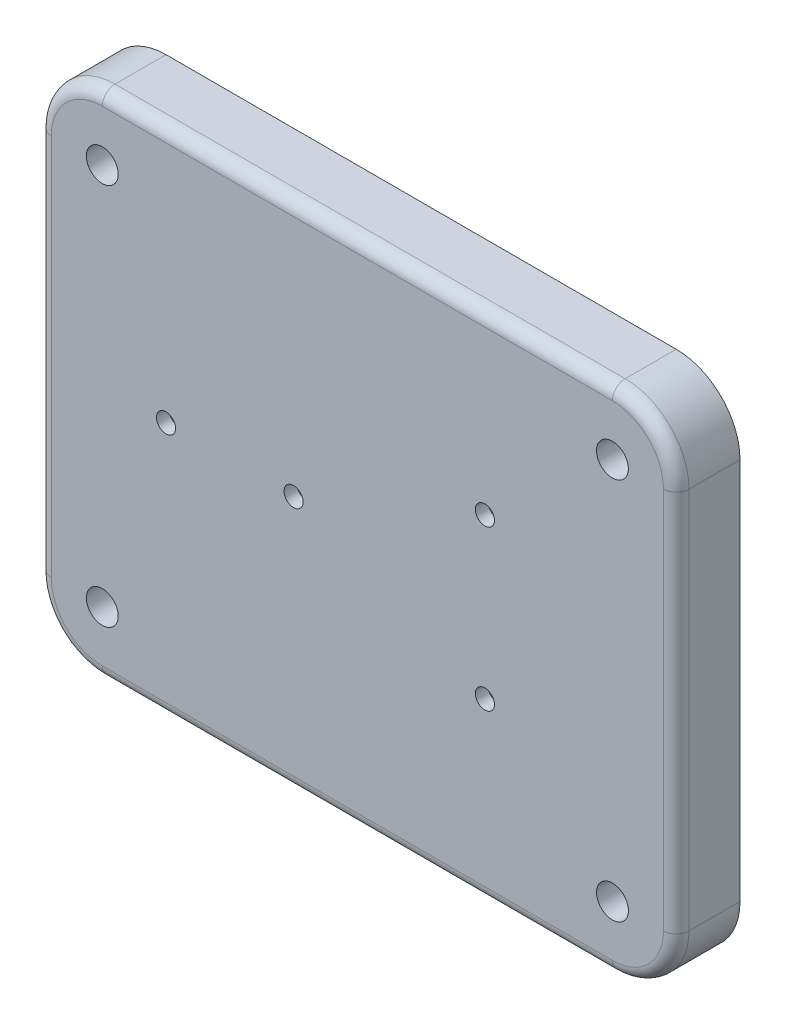
ISO-10303-21;
HEADER;
FILE_DESCRIPTION(('STEP AP214'),'2;1');
FILE_NAME('part.step','',(''),(''),'','','');
FILE_SCHEMA(('AUTOMOTIVE_DESIGN { 1 0 10303 214 1 1 1 1 }'));
ENDSEC;
DATA;
#1=APPLICATION_CONTEXT('core data for automotive mechanical design processes');
#2=APPLICATION_PROTOCOL_DEFINITION('international standard','automotive_design',2000,#1);
#3=PRODUCT_CONTEXT('',#1,'mechanical');
#4=PRODUCT('Part','Part','',(#3));
#5=PRODUCT_RELATED_PRODUCT_CATEGORY('part','',(#4));
#6=PRODUCT_DEFINITION_FORMATION('','',#4);
#7=PRODUCT_DEFINITION_CONTEXT('part definition',#1,'design');
#8=PRODUCT_DEFINITION('design','',#6,#7);
#9=PRODUCT_DEFINITION_SHAPE('','',#8);
#10=(LENGTH_UNIT() NAMED_UNIT(*) SI_UNIT(.MILLI.,.METRE.));
#11=(NAMED_UNIT(*) PLANE_ANGLE_UNIT() SI_UNIT($,.RADIAN.));
#12=(NAMED_UNIT(*) SI_UNIT($,.STERADIAN.) SOLID_ANGLE_UNIT());
#13=UNCERTAINTY_MEASURE_WITH_UNIT(LENGTH_MEASURE(1.E-05),#10,'distance_accuracy_value','');
#14=(GEOMETRIC_REPRESENTATION_CONTEXT(3) GLOBAL_UNCERTAINTY_ASSIGNED_CONTEXT((#13)) GLOBAL_UNIT_ASSIGNED_CONTEXT((#10,
#11,#12)) REPRESENTATION_CONTEXT('',''));
#15=CARTESIAN_POINT('',(0.,0.,0.));
#16=DIRECTION('',(0.,0.,1.));
#17=DIRECTION('',(1.,0.,0.));
#18=AXIS2_PLACEMENT_3D('',#15,#16,#17);
#19=CARTESIAN_POINT('',(0.,0.,0.));
#20=DIRECTION('',(0.,0.,-1.));
#21=DIRECTION('',(-1.,0.,0.));
#22=AXIS2_PLACEMENT_3D('',#19,#20,#21);
#23=PLANE('',#22);
#24=CARTESIAN_POINT('',(40.,30.,0.));
#25=DIRECTION('',(0.,0.,-1.));
#26=DIRECTION('',(-1.,0.,0.));
#27=AXIS2_PLACEMENT_3D('',#24,#25,#26);
#28=CIRCLE('',#27,2.5);
#29=CARTESIAN_POINT('',(37.5,30.,0.));
#30=VERTEX_POINT('',#29);
#31=EDGE_CURVE('E271',#30,#30,#28,.T.);
#32=ORIENTED_EDGE('',*,*,#31,.F.);
#33=EDGE_LOOP('',(#32));
#34=FACE_BOUND('',#33,.T.);
#35=CARTESIAN_POINT('',(40.,30.,0.));
#36=DIRECTION('',(0.,0.,-1.));
#37=DIRECTION('',(-1.,0.,0.));
#38=AXIS2_PLACEMENT_3D('',#35,#36,#37);
#39=CIRCLE('',#38,4.5);
#40=CARTESIAN_POINT('',(35.5,30.,0.));
#41=VERTEX_POINT('',#40);
#42=EDGE_CURVE('E225',#41,#41,#39,.T.);
#43=ORIENTED_EDGE('',*,*,#42,.T.);
#44=EDGE_LOOP('',(#43));
#45=FACE_BOUND('',#44,.T.);
#46=ADVANCED_FACE('F36',(#34,#45),#23,.T.);
#47=CARTESIAN_POINT('',(-40.,-30.,0.));
#48=DIRECTION('',(0.,0.,-1.));
#49=DIRECTION('',(1.,0.,0.));
#50=AXIS2_PLACEMENT_3D('',#47,#48,#49);
#51=CIRCLE('',#50,2.5);
#52=CARTESIAN_POINT('',(-37.5,-30.,0.));
#53=VERTEX_POINT('',#52);
#54=EDGE_CURVE('E285',#53,#53,#51,.T.);
#55=ORIENTED_EDGE('',*,*,#54,.F.);
#56=EDGE_LOOP('',(#55));
#57=FACE_BOUND('',#56,.T.);
#58=CARTESIAN_POINT('',(-40.,-30.,0.));
#59=DIRECTION('',(0.,0.,-1.));
#60=DIRECTION('',(-1.,0.,0.));
#61=AXIS2_PLACEMENT_3D('',#58,#59,#60);
#62=CIRCLE('',#61,4.5);
#63=CARTESIAN_POINT('',(-44.5,-30.,0.));
#64=VERTEX_POINT('',#63);
#65=EDGE_CURVE('E233',#64,#64,#62,.T.);
#66=ORIENTED_EDGE('',*,*,#65,.T.);
#67=EDGE_LOOP('',(#66));
#68=FACE_BOUND('',#67,.T.);
#69=ADVANCED_FACE('F470',(#57,#68),#23,.T.);
#70=CARTESIAN_POINT('',(40.,-30.,0.));
#71=DIRECTION('',(0.,0.,-1.));
#72=DIRECTION('',(-1.,0.,0.));
#73=AXIS2_PLACEMENT_3D('',#70,#71,#72);
#74=CIRCLE('',#73,4.5);
#75=CARTESIAN_POINT('',(35.5,-30.,0.));
#76=VERTEX_POINT('',#75);
#77=EDGE_CURVE('E229',#76,#76,#74,.F.);
#78=ORIENTED_EDGE('',*,*,#77,.F.);
#79=EDGE_LOOP('',(#78));
#80=FACE_BOUND('',#79,.T.);
#81=CARTESIAN_POINT('',(40.,-30.,0.));
#82=DIRECTION('',(0.,0.,1.));
#83=DIRECTION('',(-1.,0.,0.));
#84=AXIS2_PLACEMENT_3D('',#81,#82,#83);
#85=CIRCLE('',#84,2.5);
#86=CARTESIAN_POINT('',(37.5,-30.,0.));
#87=VERTEX_POINT('',#86);
#88=EDGE_CURVE('E279',#87,#87,#85,.T.);
#89=ORIENTED_EDGE('',*,*,#88,.T.);
#90=EDGE_LOOP('',(#89));
#91=FACE_BOUND('',#90,.T.);
#92=ADVANCED_FACE('F476',(#80,#91),#23,.T.);
#93=DIRECTION('',(1.,0.,0.));
#94=VECTOR('',#93,1.);
#95=CARTESIAN_POINT('',(-50.,-40.,0.));
#96=LINE('',#95,#94);
#97=CARTESIAN_POINT('',(-40.,-40.,0.));
#98=VERTEX_POINT('',#97);
#99=CARTESIAN_POINT('',(40.,-40.,0.));
#100=VERTEX_POINT('',#99);
#101=EDGE_CURVE('E305',#98,#100,#96,.T.);
#102=ORIENTED_EDGE('',*,*,#101,.F.);
#103=CARTESIAN_POINT('',(-40.,-30.,0.));
#104=DIRECTION('',(0.,0.,-1.));
#105=DIRECTION('',(-1.,0.,0.));
#106=AXIS2_PLACEMENT_3D('',#103,#104,#105);
#107=CIRCLE('',#106,10.);
#108=CARTESIAN_POINT('',(-50.,-30.,0.));
#109=VERTEX_POINT('',#108);
#110=EDGE_CURVE('E318',#98,#109,#107,.T.);
#111=ORIENTED_EDGE('',*,*,#110,.T.);
#112=DIRECTION('',(0.,-1.,0.));
#113=VECTOR('',#112,1.);
#114=CARTESIAN_POINT('',(-50.,-40.,0.));
#115=LINE('',#114,#113);
#116=CARTESIAN_POINT('',(-50.,30.,0.));
#117=VERTEX_POINT('',#116);
#118=EDGE_CURVE('E302',#117,#109,#115,.T.);
#119=ORIENTED_EDGE('',*,*,#118,.F.);
#120=CARTESIAN_POINT('',(-40.,30.,0.));
#121=DIRECTION('',(0.,0.,-1.));
#122=DIRECTION('',(-1.,0.,0.));
#123=AXIS2_PLACEMENT_3D('',#120,#121,#122);
#124=CIRCLE('',#123,10.);
#125=CARTESIAN_POINT('',(-40.,40.,0.));
#126=VERTEX_POINT('',#125);
#127=EDGE_CURVE('E312',#117,#126,#124,.T.);
#128=ORIENTED_EDGE('',*,*,#127,.T.);
#129=DIRECTION('',(-1.,0.,0.));
#130=VECTOR('',#129,1.);
#131=CARTESIAN_POINT('',(-50.,40.,0.));
#132=LINE('',#131,#130);
#133=CARTESIAN_POINT('',(40.,40.,0.));
#134=VERTEX_POINT('',#133);
#135=EDGE_CURVE('E299',#134,#126,#132,.T.);
#136=ORIENTED_EDGE('',*,*,#135,.F.);
#137=CARTESIAN_POINT('',(40.,30.,0.));
#138=DIRECTION('',(0.,0.,-1.));
#139=DIRECTION('',(-1.,0.,0.));
#140=AXIS2_PLACEMENT_3D('',#137,#138,#139);
#141=CIRCLE('',#140,10.);
#142=CARTESIAN_POINT('',(50.,30.,0.));
#143=VERTEX_POINT('',#142);
#144=EDGE_CURVE('E314',#134,#143,#141,.T.);
#145=ORIENTED_EDGE('',*,*,#144,.T.);
#146=DIRECTION('',(0.,1.,0.));
#147=VECTOR('',#146,1.);
#148=CARTESIAN_POINT('',(50.,-40.,0.));
#149=LINE('',#148,#147);
#150=CARTESIAN_POINT('',(50.,-30.,0.));
#151=VERTEX_POINT('',#150);
#152=EDGE_CURVE('E294',#151,#143,#149,.T.);
#153=ORIENTED_EDGE('',*,*,#152,.F.);
#154=CARTESIAN_POINT('',(40.,-30.,0.));
#155=DIRECTION('',(0.,0.,-1.));
#156=DIRECTION('',(-1.,0.,0.));
#157=AXIS2_PLACEMENT_3D('',#154,#155,#156);
#158=CIRCLE('',#157,10.);
#159=EDGE_CURVE('E316',#151,#100,#158,.T.);
#160=ORIENTED_EDGE('',*,*,#159,.T.);
#161=EDGE_LOOP('',(#102,#111,#119,#128,#136,#145,#153,#160));
#162=FACE_BOUND('',#161,.T.);
#163=CARTESIAN_POINT('',(-40.,-30.,0.));
#164=DIRECTION('',(0.,0.,-1.));
#165=DIRECTION('',(-1.,0.,0.));
#166=AXIS2_PLACEMENT_3D('',#163,#164,#165);
#167=CIRCLE('',#166,8.);
#168=CARTESIAN_POINT('',(-40.,-38.,0.));
#169=VERTEX_POINT('',#168);
#170=CARTESIAN_POINT('',(-48.,-30.,0.));
#171=VERTEX_POINT('',#170);
#172=EDGE_CURVE('E240',#169,#171,#167,.T.);
#173=ORIENTED_EDGE('',*,*,#172,.F.);
#174=DIRECTION('',(1.,0.,0.));
#175=VECTOR('',#174,1.);
#176=CARTESIAN_POINT('',(0.,-38.,0.));
#177=LINE('',#176,#175);
#178=CARTESIAN_POINT('',(40.,-38.,0.));
#179=VERTEX_POINT('',#178);
#180=EDGE_CURVE('E248',#169,#179,#177,.T.);
#181=ORIENTED_EDGE('',*,*,#180,.T.);
#182=CARTESIAN_POINT('',(40.,-30.,0.));
#183=DIRECTION('',(0.,0.,-1.));
#184=DIRECTION('',(-1.,0.,0.));
#185=AXIS2_PLACEMENT_3D('',#182,#183,#184);
#186=CIRCLE('',#185,8.);
#187=CARTESIAN_POINT('',(48.,-30.,0.));
#188=VERTEX_POINT('',#187);
#189=EDGE_CURVE('E251',#188,#179,#186,.T.);
#190=ORIENTED_EDGE('',*,*,#189,.F.);
#191=DIRECTION('',(0.,1.,0.));
#192=VECTOR('',#191,1.);
#193=CARTESIAN_POINT('',(48.,0.,0.));
#194=LINE('',#193,#192);
#195=CARTESIAN_POINT('',(48.,30.,0.));
#196=VERTEX_POINT('',#195);
#197=EDGE_CURVE('E53',#188,#196,#194,.T.);
#198=ORIENTED_EDGE('',*,*,#197,.T.);
#199=CARTESIAN_POINT('',(40.,30.,0.));
#200=DIRECTION('',(0.,0.,-1.));
#201=DIRECTION('',(-1.,0.,0.));
#202=AXIS2_PLACEMENT_3D('',#199,#200,#201);
#203=CIRCLE('',#202,8.);
#204=CARTESIAN_POINT('',(40.,38.,0.));
#205=VERTEX_POINT('',#204);
#206=EDGE_CURVE('E200',#205,#196,#203,.T.);
#207=ORIENTED_EDGE('',*,*,#206,.F.);
#208=DIRECTION('',(-1.,0.,0.));
#209=VECTOR('',#208,1.);
#210=CARTESIAN_POINT('',(0.,38.,0.));
#211=LINE('',#210,#209);
#212=CARTESIAN_POINT('',(-40.,38.,0.));
#213=VERTEX_POINT('',#212);
#214=EDGE_CURVE('E250',#205,#213,#211,.T.);
#215=ORIENTED_EDGE('',*,*,#214,.T.);
#216=CARTESIAN_POINT('',(-40.,30.,0.));
#217=DIRECTION('',(0.,0.,-1.));
#218=DIRECTION('',(-1.,0.,0.));
#219=AXIS2_PLACEMENT_3D('',#216,#217,#218);
#220=CIRCLE('',#219,8.);
#221=CARTESIAN_POINT('',(-48.,30.,0.));
#222=VERTEX_POINT('',#221);
#223=EDGE_CURVE('E244',#222,#213,#220,.T.);
#224=ORIENTED_EDGE('',*,*,#223,.F.);
#225=DIRECTION('',(0.,-1.,0.));
#226=VECTOR('',#225,1.);
#227=CARTESIAN_POINT('',(-48.,0.,0.));
#228=LINE('',#227,#226);
#229=EDGE_CURVE('E255',#222,#171,#228,.T.);
#230=ORIENTED_EDGE('',*,*,#229,.T.);
#231=EDGE_LOOP('',(#173,#181,#190,#198,#207,#215,#224,#230));
#232=FACE_BOUND('',#231,.T.);
#233=ADVANCED_FACE('F484',(#162,#232),#23,.T.);
#234=CARTESIAN_POINT('',(50.,-40.,10.));
#235=DIRECTION('',(-1.,0.,0.));
#236=DIRECTION('',(0.,0.,1.));
#237=AXIS2_PLACEMENT_3D('',#234,#235,#236);
#238=PLANE('',#237);
#239=DIRECTION('',(0.,0.,-1.));
#240=VECTOR('',#239,1.);
#241=CARTESIAN_POINT('',(50.,30.,10.));
#242=LINE('',#241,#240);
#243=CARTESIAN_POINT('',(50.,30.,8.));
#244=VERTEX_POINT('',#243);
#245=EDGE_CURVE('E325',#143,#244,#242,.F.);
#246=ORIENTED_EDGE('',*,*,#245,.T.);
#247=DIRECTION('',(0.,1.,0.));
#248=VECTOR('',#247,1.);
#249=CARTESIAN_POINT('',(50.,-40.,8.));
#250=LINE('',#249,#248);
#251=CARTESIAN_POINT('',(50.,-30.,8.));
#252=VERTEX_POINT('',#251);
#253=EDGE_CURVE('E363',#244,#252,#250,.F.);
#254=ORIENTED_EDGE('',*,*,#253,.T.);
#255=DIRECTION('',(0.,0.,-1.));
#256=VECTOR('',#255,1.);
#257=CARTESIAN_POINT('',(50.,-30.,10.));
#258=LINE('',#257,#256);
#259=EDGE_CURVE('E328',#252,#151,#258,.T.);
#260=ORIENTED_EDGE('',*,*,#259,.T.);
#261=ORIENTED_EDGE('',*,*,#152,.T.);
#262=EDGE_LOOP('',(#246,#254,#260,#261));
#263=FACE_BOUND('',#262,.T.);
#264=ADVANCED_FACE('F494',(#263),#238,.F.);
#265=CARTESIAN_POINT('',(-50.,40.,10.));
#266=DIRECTION('',(0.,-1.,0.));
#267=DIRECTION('',(0.,0.,-1.));
#268=AXIS2_PLACEMENT_3D('',#265,#266,#267);
#269=PLANE('',#268);
#270=DIRECTION('',(0.,0.,-1.));
#271=VECTOR('',#270,1.);
#272=CARTESIAN_POINT('',(-40.,40.,10.));
#273=LINE('',#272,#271);
#274=CARTESIAN_POINT('',(-40.,40.,8.));
#275=VERTEX_POINT('',#274);
#276=EDGE_CURVE('E330',#126,#275,#273,.F.);
#277=ORIENTED_EDGE('',*,*,#276,.T.);
#278=DIRECTION('',(-1.,0.,0.));
#279=VECTOR('',#278,1.);
#280=CARTESIAN_POINT('',(-50.,40.,8.));
#281=LINE('',#280,#279);
#282=CARTESIAN_POINT('',(40.,40.,8.));
#283=VERTEX_POINT('',#282);
#284=EDGE_CURVE('E359',#275,#283,#281,.F.);
#285=ORIENTED_EDGE('',*,*,#284,.T.);
#286=DIRECTION('',(0.,0.,-1.));
#287=VECTOR('',#286,1.);
#288=CARTESIAN_POINT('',(40.,40.,10.));
#289=LINE('',#288,#287);
#290=EDGE_CURVE('E333',#283,#134,#289,.T.);
#291=ORIENTED_EDGE('',*,*,#290,.T.);
#292=ORIENTED_EDGE('',*,*,#135,.T.);
#293=EDGE_LOOP('',(#277,#285,#291,#292));
#294=FACE_BOUND('',#293,.T.);
#295=ADVANCED_FACE('F500',(#294),#269,.F.);
#296=CARTESIAN_POINT('',(-50.,-40.,10.));
#297=DIRECTION('',(1.,0.,0.));
#298=DIRECTION('',(0.,0.,-1.));
#299=AXIS2_PLACEMENT_3D('',#296,#297,#298);
#300=PLANE('',#299);
#301=DIRECTION('',(0.,0.,-1.));
#302=VECTOR('',#301,1.);
#303=CARTESIAN_POINT('',(-50.,-30.,10.));
#304=LINE('',#303,#302);
#305=CARTESIAN_POINT('',(-50.,-30.,8.));
#306=VERTEX_POINT('',#305);
#307=EDGE_CURVE('E322',#109,#306,#304,.F.);
#308=ORIENTED_EDGE('',*,*,#307,.T.);
#309=DIRECTION('',(0.,-1.,0.));
#310=VECTOR('',#309,1.);
#311=CARTESIAN_POINT('',(-50.,-40.,8.));
#312=LINE('',#311,#310);
#313=CARTESIAN_POINT('',(-50.,30.,8.));
#314=VERTEX_POINT('',#313);
#315=EDGE_CURVE('E355',#306,#314,#312,.F.);
#316=ORIENTED_EDGE('',*,*,#315,.T.);
#317=DIRECTION('',(0.,0.,-1.));
#318=VECTOR('',#317,1.);
#319=CARTESIAN_POINT('',(-50.,30.,10.));
#320=LINE('',#319,#318);
#321=EDGE_CURVE('E320',#314,#117,#320,.T.);
#322=ORIENTED_EDGE('',*,*,#321,.T.);
#323=ORIENTED_EDGE('',*,*,#118,.T.);
#324=EDGE_LOOP('',(#308,#316,#322,#323));
#325=FACE_BOUND('',#324,.T.);
#326=ADVANCED_FACE('F762',(#325),#300,.F.);
#327=CARTESIAN_POINT('',(-50.,-40.,10.));
#328=DIRECTION('',(0.,1.,0.));
#329=DIRECTION('',(0.,0.,1.));
#330=AXIS2_PLACEMENT_3D('',#327,#328,#329);
#331=PLANE('',#330);
#332=DIRECTION('',(0.,0.,-1.));
#333=VECTOR('',#332,1.);
#334=CARTESIAN_POINT('',(40.,-40.,10.));
#335=LINE('',#334,#333);
#336=CARTESIAN_POINT('',(40.,-40.,8.));
#337=VERTEX_POINT('',#336);
#338=EDGE_CURVE('E308',#100,#337,#335,.F.);
#339=ORIENTED_EDGE('',*,*,#338,.T.);
#340=DIRECTION('',(1.,0.,0.));
#341=VECTOR('',#340,1.);
#342=CARTESIAN_POINT('',(-50.,-40.,8.));
#343=LINE('',#342,#341);
#344=CARTESIAN_POINT('',(-40.,-40.,8.));
#345=VERTEX_POINT('',#344);
#346=EDGE_CURVE('E11',#337,#345,#343,.F.);
#347=ORIENTED_EDGE('',*,*,#346,.T.);
#348=DIRECTION('',(0.,0.,-1.));
#349=VECTOR('',#348,1.);
#350=CARTESIAN_POINT('',(-40.,-40.,10.));
#351=LINE('',#350,#349);
#352=EDGE_CURVE('E310',#345,#98,#351,.T.);
#353=ORIENTED_EDGE('',*,*,#352,.T.);
#354=ORIENTED_EDGE('',*,*,#101,.T.);
#355=EDGE_LOOP('',(#339,#347,#353,#354));
#356=FACE_BOUND('',#355,.T.);
#357=ADVANCED_FACE('F436',(#356),#331,.F.);
#358=CARTESIAN_POINT('',(0.,0.,10.));
#359=DIRECTION('',(0.,0.,-1.));
#360=DIRECTION('',(-1.,0.,0.));
#361=AXIS2_PLACEMENT_3D('',#358,#359,#360);
#362=PLANE('',#361);
#363=CARTESIAN_POINT('',(20.,12.5,10.));
#364=DIRECTION('',(0.,0.,1.));
#365=DIRECTION('',(1.,0.,0.));
#366=AXIS2_PLACEMENT_3D('',#363,#364,#365);
#367=CIRCLE('',#366,1.5);
#368=CARTESIAN_POINT('',(21.5,12.5,10.));
#369=VERTEX_POINT('',#368);
#370=EDGE_CURVE('E427',#369,#369,#367,.T.);
#371=ORIENTED_EDGE('',*,*,#370,.F.);
#372=EDGE_LOOP('',(#371));
#373=FACE_BOUND('',#372,.T.);
#374=CARTESIAN_POINT('',(20.,-12.5,10.));
#375=DIRECTION('',(0.,0.,1.));
#376=DIRECTION('',(1.,0.,0.));
#377=AXIS2_PLACEMENT_3D('',#374,#375,#376);
#378=CIRCLE('',#377,1.5);
#379=CARTESIAN_POINT('',(21.5,-12.5,10.));
#380=VERTEX_POINT('',#379);
#381=EDGE_CURVE('E422',#380,#380,#378,.T.);
#382=ORIENTED_EDGE('',*,*,#381,.F.);
#383=EDGE_LOOP('',(#382));
#384=FACE_BOUND('',#383,.T.);
#385=CARTESIAN_POINT('',(-30.,0.,10.));
#386=DIRECTION('',(0.,0.,1.));
#387=DIRECTION('',(1.,0.,0.));
#388=AXIS2_PLACEMENT_3D('',#385,#386,#387);
#389=CIRCLE('',#388,1.5);
#390=CARTESIAN_POINT('',(-28.5,0.,10.));
#391=VERTEX_POINT('',#390);
#392=EDGE_CURVE('E420',#391,#391,#389,.T.);
#393=ORIENTED_EDGE('',*,*,#392,.F.);
#394=EDGE_LOOP('',(#393));
#395=FACE_BOUND('',#394,.T.);
#396=CARTESIAN_POINT('',(-10.,0.,10.));
#397=DIRECTION('',(0.,0.,1.));
#398=DIRECTION('',(1.,0.,0.));
#399=AXIS2_PLACEMENT_3D('',#396,#397,#398);
#400=CIRCLE('',#399,1.5);
#401=CARTESIAN_POINT('',(-8.5,0.,10.));
#402=VERTEX_POINT('',#401);
#403=EDGE_CURVE('E208',#402,#402,#400,.T.);
#404=ORIENTED_EDGE('',*,*,#403,.F.);
#405=EDGE_LOOP('',(#404));
#406=FACE_BOUND('',#405,.T.);
#407=DIRECTION('',(0.,-1.,0.));
#408=VECTOR('',#407,1.);
#409=CARTESIAN_POINT('',(-48.,0.,10.));
#410=LINE('',#409,#408);
#411=CARTESIAN_POINT('',(-48.,30.,10.));
#412=VERTEX_POINT('',#411);
#413=CARTESIAN_POINT('',(-48.,-30.,10.));
#414=VERTEX_POINT('',#413);
#415=EDGE_CURVE('E347',#412,#414,#410,.T.);
#416=ORIENTED_EDGE('',*,*,#415,.T.);
#417=CARTESIAN_POINT('',(-40.,-30.,10.));
#418=DIRECTION('',(0.,0.,-1.));
#419=DIRECTION('',(-1.,0.,0.));
#420=AXIS2_PLACEMENT_3D('',#417,#418,#419);
#421=CIRCLE('',#420,8.);
#422=CARTESIAN_POINT('',(-40.,-38.,10.));
#423=VERTEX_POINT('',#422);
#424=EDGE_CURVE('E349',#414,#423,#421,.F.);
#425=ORIENTED_EDGE('',*,*,#424,.T.);
#426=DIRECTION('',(1.,0.,0.));
#427=VECTOR('',#426,1.);
#428=CARTESIAN_POINT('',(0.,-38.,10.));
#429=LINE('',#428,#427);
#430=CARTESIAN_POINT('',(40.,-38.,10.));
#431=VERTEX_POINT('',#430);
#432=EDGE_CURVE('E335',#423,#431,#429,.T.);
#433=ORIENTED_EDGE('',*,*,#432,.T.);
#434=CARTESIAN_POINT('',(40.,-30.,10.));
#435=DIRECTION('',(0.,0.,-1.));
#436=DIRECTION('',(-1.,0.,0.));
#437=AXIS2_PLACEMENT_3D('',#434,#435,#436);
#438=CIRCLE('',#437,8.);
#439=CARTESIAN_POINT('',(48.,-30.,10.));
#440=VERTEX_POINT('',#439);
#441=EDGE_CURVE('E337',#431,#440,#438,.F.);
#442=ORIENTED_EDGE('',*,*,#441,.T.);
#443=DIRECTION('',(0.,1.,0.));
#444=VECTOR('',#443,1.);
#445=CARTESIAN_POINT('',(48.,0.,10.));
#446=LINE('',#445,#444);
#447=CARTESIAN_POINT('',(48.,30.,10.));
#448=VERTEX_POINT('',#447);
#449=EDGE_CURVE('E339',#440,#448,#446,.T.);
#450=ORIENTED_EDGE('',*,*,#449,.T.);
#451=CARTESIAN_POINT('',(40.,30.,10.));
#452=DIRECTION('',(0.,0.,-1.));
#453=DIRECTION('',(-1.,0.,0.));
#454=AXIS2_PLACEMENT_3D('',#451,#452,#453);
#455=CIRCLE('',#454,8.);
#456=CARTESIAN_POINT('',(40.,38.,10.));
#457=VERTEX_POINT('',#456);
#458=EDGE_CURVE('E341',#448,#457,#455,.F.);
#459=ORIENTED_EDGE('',*,*,#458,.T.);
#460=DIRECTION('',(-1.,0.,0.));
#461=VECTOR('',#460,1.);
#462=CARTESIAN_POINT('',(0.,38.,10.));
#463=LINE('',#462,#461);
#464=CARTESIAN_POINT('',(-40.,38.,10.));
#465=VERTEX_POINT('',#464);
#466=EDGE_CURVE('E343',#457,#465,#463,.T.);
#467=ORIENTED_EDGE('',*,*,#466,.T.);
#468=CARTESIAN_POINT('',(-40.,30.,10.));
#469=DIRECTION('',(0.,0.,-1.));
#470=DIRECTION('',(-1.,0.,0.));
#471=AXIS2_PLACEMENT_3D('',#468,#469,#470);
#472=CIRCLE('',#471,8.);
#473=EDGE_CURVE('E345',#465,#412,#472,.F.);
#474=ORIENTED_EDGE('',*,*,#473,.T.);
#475=EDGE_LOOP('',(#416,#425,#433,#442,#450,#459,#467,#474));
#476=FACE_BOUND('',#475,.T.);
#477=CARTESIAN_POINT('',(40.,30.,10.));
#478=DIRECTION('',(0.,0.,-1.));
#479=DIRECTION('',(-1.,0.,0.));
#480=AXIS2_PLACEMENT_3D('',#477,#478,#479);
#481=CIRCLE('',#480,2.5);
#482=CARTESIAN_POINT('',(37.5,30.,10.));
#483=VERTEX_POINT('',#482);
#484=EDGE_CURVE('E275',#483,#483,#481,.T.);
#485=ORIENTED_EDGE('',*,*,#484,.T.);
#486=EDGE_LOOP('',(#485));
#487=FACE_BOUND('',#486,.T.);
#488=CARTESIAN_POINT('',(40.,-30.,10.));
#489=DIRECTION('',(0.,0.,1.));
#490=DIRECTION('',(-1.,0.,0.));
#491=AXIS2_PLACEMENT_3D('',#488,#489,#490);
#492=CIRCLE('',#491,2.5);
#493=CARTESIAN_POINT('',(37.5,-30.,10.));
#494=VERTEX_POINT('',#493);
#495=EDGE_CURVE('E274',#494,#494,#492,.T.);
#496=ORIENTED_EDGE('',*,*,#495,.F.);
#497=EDGE_LOOP('',(#496));
#498=FACE_BOUND('',#497,.T.);
#499=CARTESIAN_POINT('',(-40.,-30.,10.));
#500=DIRECTION('',(0.,0.,-1.));
#501=DIRECTION('',(1.,0.,0.));
#502=AXIS2_PLACEMENT_3D('',#499,#500,#501);
#503=CIRCLE('',#502,2.5);
#504=CARTESIAN_POINT('',(-37.5,-30.,10.));
#505=VERTEX_POINT('',#504);
#506=EDGE_CURVE('E282',#505,#505,#503,.T.);
#507=ORIENTED_EDGE('',*,*,#506,.T.);
#508=EDGE_LOOP('',(#507));
#509=FACE_BOUND('',#508,.T.);
#510=CARTESIAN_POINT('',(-40.,30.,10.));
#511=DIRECTION('',(0.,0.,1.));
#512=DIRECTION('',(1.,0.,0.));
#513=AXIS2_PLACEMENT_3D('',#510,#511,#512);
#514=CIRCLE('',#513,2.5);
#515=CARTESIAN_POINT('',(-37.5,30.,10.));
#516=VERTEX_POINT('',#515);
#517=EDGE_CURVE('E288',#516,#516,#514,.T.);
#518=ORIENTED_EDGE('',*,*,#517,.F.);
#519=EDGE_LOOP('',(#518));
#520=FACE_BOUND('',#519,.T.);
#521=ADVANCED_FACE('F432',(#373,#384,#395,#406,#476,#487,#498,#509,#520),#362,.F.);
#522=CARTESIAN_POINT('',(-40.,30.,0.));
#523=DIRECTION('',(0.,0.,-1.));
#524=DIRECTION('',(-1.,0.,0.));
#525=AXIS2_PLACEMENT_3D('',#522,#523,#524);
#526=CIRCLE('',#525,4.5);
#527=CARTESIAN_POINT('',(-44.5,30.,0.));
#528=VERTEX_POINT('',#527);
#529=EDGE_CURVE('E237',#528,#528,#526,.F.);
#530=ORIENTED_EDGE('',*,*,#529,.F.);
#531=EDGE_LOOP('',(#530));
#532=FACE_BOUND('',#531,.T.);
#533=CARTESIAN_POINT('',(-40.,30.,0.));
#534=DIRECTION('',(0.,0.,1.));
#535=DIRECTION('',(1.,0.,0.));
#536=AXIS2_PLACEMENT_3D('',#533,#534,#535);
#537=CIRCLE('',#536,2.5);
#538=CARTESIAN_POINT('',(-37.5,30.,0.));
#539=VERTEX_POINT('',#538);
#540=EDGE_CURVE('E291',#539,#539,#537,.T.);
#541=ORIENTED_EDGE('',*,*,#540,.T.);
#542=EDGE_LOOP('',(#541));
#543=FACE_BOUND('',#542,.T.);
#544=ADVANCED_FACE('F435',(#532,#543),#23,.T.);
#545=CARTESIAN_POINT('',(-40.,-30.,10.));
#546=DIRECTION('',(0.,0.,-1.));
#547=DIRECTION('',(-1.,0.,0.));
#548=AXIS2_PLACEMENT_3D('',#545,#546,#547);
#549=CYLINDRICAL_SURFACE('',#548,10.);
#550=ORIENTED_EDGE('',*,*,#352,.F.);
#551=CARTESIAN_POINT('',(-40.,-30.,8.));
#552=DIRECTION('',(0.,0.,-1.));
#553=DIRECTION('',(-1.,0.,0.));
#554=AXIS2_PLACEMENT_3D('',#551,#552,#553);
#555=CIRCLE('',#554,10.);
#556=EDGE_CURVE('E352',#345,#306,#555,.T.);
#557=ORIENTED_EDGE('',*,*,#556,.T.);
#558=ORIENTED_EDGE('',*,*,#307,.F.);
#559=ORIENTED_EDGE('',*,*,#110,.F.);
#560=EDGE_LOOP('',(#550,#557,#558,#559));
#561=FACE_BOUND('',#560,.T.);
#562=ADVANCED_FACE('F482',(#561),#549,.T.);
#563=CARTESIAN_POINT('',(40.,-30.,10.));
#564=DIRECTION('',(0.,0.,-1.));
#565=DIRECTION('',(-1.,0.,0.));
#566=AXIS2_PLACEMENT_3D('',#563,#564,#565);
#567=CYLINDRICAL_SURFACE('',#566,10.);
#568=ORIENTED_EDGE('',*,*,#259,.F.);
#569=CARTESIAN_POINT('',(40.,-30.,8.));
#570=DIRECTION('',(0.,0.,-1.));
#571=DIRECTION('',(-1.,0.,0.));
#572=AXIS2_PLACEMENT_3D('',#569,#570,#571);
#573=CIRCLE('',#572,10.);
#574=EDGE_CURVE('E45',#252,#337,#573,.T.);
#575=ORIENTED_EDGE('',*,*,#574,.T.);
#576=ORIENTED_EDGE('',*,*,#338,.F.);
#577=ORIENTED_EDGE('',*,*,#159,.F.);
#578=EDGE_LOOP('',(#568,#575,#576,#577));
#579=FACE_BOUND('',#578,.T.);
#580=ADVANCED_FACE('F488',(#579),#567,.T.);
#581=CARTESIAN_POINT('',(40.,30.,10.));
#582=DIRECTION('',(0.,0.,-1.));
#583=DIRECTION('',(-1.,0.,0.));
#584=AXIS2_PLACEMENT_3D('',#581,#582,#583);
#585=CYLINDRICAL_SURFACE('',#584,10.);
#586=ORIENTED_EDGE('',*,*,#290,.F.);
#587=CARTESIAN_POINT('',(40.,30.,8.));
#588=DIRECTION('',(0.,0.,-1.));
#589=DIRECTION('',(-1.,0.,0.));
#590=AXIS2_PLACEMENT_3D('',#587,#588,#589);
#591=CIRCLE('',#590,10.);
#592=EDGE_CURVE('E361',#283,#244,#591,.T.);
#593=ORIENTED_EDGE('',*,*,#592,.T.);
#594=ORIENTED_EDGE('',*,*,#245,.F.);
#595=ORIENTED_EDGE('',*,*,#144,.F.);
#596=EDGE_LOOP('',(#586,#593,#594,#595));
#597=FACE_BOUND('',#596,.T.);
#598=ADVANCED_FACE('F465',(#597),#585,.T.);
#599=CARTESIAN_POINT('',(-40.,30.,10.));
#600=DIRECTION('',(0.,0.,-1.));
#601=DIRECTION('',(-1.,0.,0.));
#602=AXIS2_PLACEMENT_3D('',#599,#600,#601);
#603=CYLINDRICAL_SURFACE('',#602,10.);
#604=ORIENTED_EDGE('',*,*,#321,.F.);
#605=CARTESIAN_POINT('',(-40.,30.,8.));
#606=DIRECTION('',(0.,0.,-1.));
#607=DIRECTION('',(-1.,0.,0.));
#608=AXIS2_PLACEMENT_3D('',#605,#606,#607);
#609=CIRCLE('',#608,10.);
#610=EDGE_CURVE('E357',#314,#275,#609,.T.);
#611=ORIENTED_EDGE('',*,*,#610,.T.);
#612=ORIENTED_EDGE('',*,*,#276,.F.);
#613=ORIENTED_EDGE('',*,*,#127,.F.);
#614=EDGE_LOOP('',(#604,#611,#612,#613));
#615=FACE_BOUND('',#614,.T.);
#616=ADVANCED_FACE('F455',(#615),#603,.T.);
#617=CARTESIAN_POINT('',(-40.,30.,0.));
#618=DIRECTION('',(0.,0.,1.));
#619=DIRECTION('',(1.,0.,0.));
#620=AXIS2_PLACEMENT_3D('',#617,#618,#619);
#621=CYLINDRICAL_SURFACE('',#620,2.5);
#622=ORIENTED_EDGE('',*,*,#540,.F.);
#623=EDGE_LOOP('',(#622));
#624=FACE_BOUND('',#623,.T.);
#625=ORIENTED_EDGE('',*,*,#517,.T.);
#626=EDGE_LOOP('',(#625));
#627=FACE_BOUND('',#626,.T.);
#628=ADVANCED_FACE('F452',(#624,#627),#621,.F.);
#629=CARTESIAN_POINT('',(-40.,-30.,0.));
#630=DIRECTION('',(0.,0.,1.));
#631=DIRECTION('',(1.,0.,0.));
#632=AXIS2_PLACEMENT_3D('',#629,#630,#631);
#633=CYLINDRICAL_SURFACE('',#632,2.5);
#634=ORIENTED_EDGE('',*,*,#54,.T.);
#635=EDGE_LOOP('',(#634));
#636=FACE_BOUND('',#635,.T.);
#637=ORIENTED_EDGE('',*,*,#506,.F.);
#638=EDGE_LOOP('',(#637));
#639=FACE_BOUND('',#638,.T.);
#640=ADVANCED_FACE('F454',(#636,#639),#633,.F.);
#641=CARTESIAN_POINT('',(40.,-30.,0.));
#642=DIRECTION('',(0.,0.,1.));
#643=DIRECTION('',(1.,0.,0.));
#644=AXIS2_PLACEMENT_3D('',#641,#642,#643);
#645=CYLINDRICAL_SURFACE('',#644,2.5);
#646=ORIENTED_EDGE('',*,*,#88,.F.);
#647=EDGE_LOOP('',(#646));
#648=FACE_BOUND('',#647,.T.);
#649=ORIENTED_EDGE('',*,*,#495,.T.);
#650=EDGE_LOOP('',(#649));
#651=FACE_BOUND('',#650,.T.);
#652=ADVANCED_FACE('F462',(#648,#651),#645,.F.);
#653=CARTESIAN_POINT('',(40.,30.,0.));
#654=DIRECTION('',(0.,0.,1.));
#655=DIRECTION('',(1.,0.,0.));
#656=AXIS2_PLACEMENT_3D('',#653,#654,#655);
#657=CYLINDRICAL_SURFACE('',#656,2.5);
#658=ORIENTED_EDGE('',*,*,#31,.T.);
#659=EDGE_LOOP('',(#658));
#660=FACE_BOUND('',#659,.T.);
#661=ORIENTED_EDGE('',*,*,#484,.F.);
#662=EDGE_LOOP('',(#661));
#663=FACE_BOUND('',#662,.T.);
#664=ADVANCED_FACE('F560',(#660,#663),#657,.F.);
#665=CARTESIAN_POINT('',(40.,30.,8.));
#666=DIRECTION('',(0.,0.,-1.));
#667=DIRECTION('',(-1.,0.,0.));
#668=AXIS2_PLACEMENT_3D('',#665,#666,#667);
#669=TOROIDAL_SURFACE('',#668,8.,2.);
#670=CARTESIAN_POINT('',(48.,30.,8.));
#671=DIRECTION('',(0.,-1.,0.));
#672=DIRECTION('',(0.,0.,-1.));
#673=AXIS2_PLACEMENT_3D('',#670,#671,#672);
#674=CIRCLE('',#673,2.);
#675=EDGE_CURVE('E381',#244,#448,#674,.T.);
#676=ORIENTED_EDGE('',*,*,#675,.F.);
#677=ORIENTED_EDGE('',*,*,#592,.F.);
#678=CARTESIAN_POINT('',(40.,38.,8.));
#679=DIRECTION('',(-1.,0.,0.));
#680=DIRECTION('',(0.,0.,1.));
#681=AXIS2_PLACEMENT_3D('',#678,#679,#680);
#682=CIRCLE('',#681,2.);
#683=EDGE_CURVE('E278',#457,#283,#682,.T.);
#684=ORIENTED_EDGE('',*,*,#683,.F.);
#685=ORIENTED_EDGE('',*,*,#458,.F.);
#686=EDGE_LOOP('',(#676,#677,#684,#685));
#687=FACE_BOUND('',#686,.T.);
#688=ADVANCED_FACE('F38',(#687),#669,.T.);
#689=CARTESIAN_POINT('',(0.,38.,8.));
#690=DIRECTION('',(-1.,0.,0.));
#691=DIRECTION('',(0.,0.,1.));
#692=AXIS2_PLACEMENT_3D('',#689,#690,#691);
#693=CYLINDRICAL_SURFACE('',#692,2.);
#694=ORIENTED_EDGE('',*,*,#683,.T.);
#695=ORIENTED_EDGE('',*,*,#284,.F.);
#696=CARTESIAN_POINT('',(-40.,38.,8.));
#697=DIRECTION('',(-1.,0.,0.));
#698=DIRECTION('',(0.,0.,1.));
#699=AXIS2_PLACEMENT_3D('',#696,#697,#698);
#700=CIRCLE('',#699,2.);
#701=EDGE_CURVE('E378',#465,#275,#700,.T.);
#702=ORIENTED_EDGE('',*,*,#701,.F.);
#703=ORIENTED_EDGE('',*,*,#466,.F.);
#704=EDGE_LOOP('',(#694,#695,#702,#703));
#705=FACE_BOUND('',#704,.T.);
#706=ADVANCED_FACE('F584',(#705),#693,.T.);
#707=CARTESIAN_POINT('',(48.,0.,8.));
#708=DIRECTION('',(0.,1.,0.));
#709=DIRECTION('',(0.,0.,1.));
#710=AXIS2_PLACEMENT_3D('',#707,#708,#709);
#711=CYLINDRICAL_SURFACE('',#710,2.);
#712=ORIENTED_EDGE('',*,*,#675,.T.);
#713=ORIENTED_EDGE('',*,*,#449,.F.);
#714=CARTESIAN_POINT('',(48.,-30.,8.));
#715=DIRECTION('',(0.,-1.,0.));
#716=DIRECTION('',(0.,0.,-1.));
#717=AXIS2_PLACEMENT_3D('',#714,#715,#716);
#718=CIRCLE('',#717,2.);
#719=EDGE_CURVE('E375',#252,#440,#718,.T.);
#720=ORIENTED_EDGE('',*,*,#719,.F.);
#721=ORIENTED_EDGE('',*,*,#253,.F.);
#722=EDGE_LOOP('',(#712,#713,#720,#721));
#723=FACE_BOUND('',#722,.T.);
#724=ADVANCED_FACE('F592',(#723),#711,.T.);
#725=CARTESIAN_POINT('',(-40.,30.,8.));
#726=DIRECTION('',(0.,0.,-1.));
#727=DIRECTION('',(-1.,0.,0.));
#728=AXIS2_PLACEMENT_3D('',#725,#726,#727);
#729=TOROIDAL_SURFACE('',#728,8.,2.);
#730=ORIENTED_EDGE('',*,*,#701,.T.);
#731=ORIENTED_EDGE('',*,*,#610,.F.);
#732=CARTESIAN_POINT('',(-48.,30.,8.));
#733=DIRECTION('',(0.,-1.,0.));
#734=DIRECTION('',(0.,0.,-1.));
#735=AXIS2_PLACEMENT_3D('',#732,#733,#734);
#736=CIRCLE('',#735,2.);
#737=EDGE_CURVE('E372',#412,#314,#736,.T.);
#738=ORIENTED_EDGE('',*,*,#737,.F.);
#739=ORIENTED_EDGE('',*,*,#473,.F.);
#740=EDGE_LOOP('',(#730,#731,#738,#739));
#741=FACE_BOUND('',#740,.T.);
#742=ADVANCED_FACE('F599',(#741),#729,.T.);
#743=CARTESIAN_POINT('',(40.,-30.,8.));
#744=DIRECTION('',(0.,0.,-1.));
#745=DIRECTION('',(-1.,0.,0.));
#746=AXIS2_PLACEMENT_3D('',#743,#744,#745);
#747=TOROIDAL_SURFACE('',#746,8.,2.);
#748=ORIENTED_EDGE('',*,*,#719,.T.);
#749=ORIENTED_EDGE('',*,*,#441,.F.);
#750=CARTESIAN_POINT('',(40.,-38.,8.));
#751=DIRECTION('',(-1.,0.,0.));
#752=DIRECTION('',(0.,0.,1.));
#753=AXIS2_PLACEMENT_3D('',#750,#751,#752);
#754=CIRCLE('',#753,2.);
#755=EDGE_CURVE('E369',#337,#431,#754,.T.);
#756=ORIENTED_EDGE('',*,*,#755,.F.);
#757=ORIENTED_EDGE('',*,*,#574,.F.);
#758=EDGE_LOOP('',(#748,#749,#756,#757));
#759=FACE_BOUND('',#758,.T.);
#760=ADVANCED_FACE('F607',(#759),#747,.T.);
#761=CARTESIAN_POINT('',(-48.,0.,8.));
#762=DIRECTION('',(0.,-1.,0.));
#763=DIRECTION('',(0.,0.,-1.));
#764=AXIS2_PLACEMENT_3D('',#761,#762,#763);
#765=CYLINDRICAL_SURFACE('',#764,2.);
#766=ORIENTED_EDGE('',*,*,#737,.T.);
#767=ORIENTED_EDGE('',*,*,#315,.F.);
#768=CARTESIAN_POINT('',(-48.,-30.,8.));
#769=DIRECTION('',(0.,-1.,0.));
#770=DIRECTION('',(0.,0.,-1.));
#771=AXIS2_PLACEMENT_3D('',#768,#769,#770);
#772=CIRCLE('',#771,2.);
#773=EDGE_CURVE('E367',#414,#306,#772,.T.);
#774=ORIENTED_EDGE('',*,*,#773,.F.);
#775=ORIENTED_EDGE('',*,*,#415,.F.);
#776=EDGE_LOOP('',(#766,#767,#774,#775));
#777=FACE_BOUND('',#776,.T.);
#778=ADVANCED_FACE('F615',(#777),#765,.T.);
#779=CARTESIAN_POINT('',(0.,-38.,8.));
#780=DIRECTION('',(1.,0.,0.));
#781=DIRECTION('',(0.,0.,-1.));
#782=AXIS2_PLACEMENT_3D('',#779,#780,#781);
#783=CYLINDRICAL_SURFACE('',#782,2.);
#784=ORIENTED_EDGE('',*,*,#755,.T.);
#785=ORIENTED_EDGE('',*,*,#432,.F.);
#786=CARTESIAN_POINT('',(-40.,-38.,8.));
#787=DIRECTION('',(-1.,0.,0.));
#788=DIRECTION('',(0.,0.,1.));
#789=AXIS2_PLACEMENT_3D('',#786,#787,#788);
#790=CIRCLE('',#789,2.);
#791=EDGE_CURVE('E196',#345,#423,#790,.T.);
#792=ORIENTED_EDGE('',*,*,#791,.F.);
#793=ORIENTED_EDGE('',*,*,#346,.F.);
#794=EDGE_LOOP('',(#784,#785,#792,#793));
#795=FACE_BOUND('',#794,.T.);
#796=ADVANCED_FACE('F623',(#795),#783,.T.);
#797=CARTESIAN_POINT('',(-40.,-30.,8.));
#798=DIRECTION('',(0.,0.,-1.));
#799=DIRECTION('',(-1.,0.,0.));
#800=AXIS2_PLACEMENT_3D('',#797,#798,#799);
#801=TOROIDAL_SURFACE('',#800,8.,2.);
#802=ORIENTED_EDGE('',*,*,#773,.T.);
#803=ORIENTED_EDGE('',*,*,#556,.F.);
#804=ORIENTED_EDGE('',*,*,#791,.T.);
#805=ORIENTED_EDGE('',*,*,#424,.F.);
#806=EDGE_LOOP('',(#802,#803,#804,#805));
#807=FACE_BOUND('',#806,.T.);
#808=ADVANCED_FACE('F631',(#807),#801,.T.);
#809=CARTESIAN_POINT('',(48.,-40.,10.));
#810=DIRECTION('',(-1.,0.,0.));
#811=DIRECTION('',(0.,0.,1.));
#812=AXIS2_PLACEMENT_3D('',#809,#810,#811);
#813=PLANE('',#812);
#814=DIRECTION('',(0.,0.,1.));
#815=VECTOR('',#814,1.);
#816=CARTESIAN_POINT('',(48.,30.,10.));
#817=LINE('',#816,#815);
#818=CARTESIAN_POINT('',(48.,30.,8.));
#819=VERTEX_POINT('',#818);
#820=EDGE_CURVE('E179',#196,#819,#817,.T.);
#821=ORIENTED_EDGE('',*,*,#820,.F.);
#822=ORIENTED_EDGE('',*,*,#197,.F.);
#823=DIRECTION('',(0.,0.,1.));
#824=VECTOR('',#823,1.);
#825=CARTESIAN_POINT('',(48.,-30.,10.));
#826=LINE('',#825,#824);
#827=CARTESIAN_POINT('',(48.,-30.,8.));
#828=VERTEX_POINT('',#827);
#829=EDGE_CURVE('E180',#828,#188,#826,.F.);
#830=ORIENTED_EDGE('',*,*,#829,.F.);
#831=DIRECTION('',(0.,1.,0.));
#832=VECTOR('',#831,1.);
#833=CARTESIAN_POINT('',(48.,0.,8.));
#834=LINE('',#833,#832);
#835=EDGE_CURVE('E175',#828,#819,#834,.T.);
#836=ORIENTED_EDGE('',*,*,#835,.T.);
#837=EDGE_LOOP('',(#821,#822,#830,#836));
#838=FACE_BOUND('',#837,.T.);
#839=ADVANCED_FACE('F177',(#838),#813,.T.);
#840=CARTESIAN_POINT('',(-50.,38.,10.));
#841=DIRECTION('',(0.,-1.,0.));
#842=DIRECTION('',(0.,0.,-1.));
#843=AXIS2_PLACEMENT_3D('',#840,#841,#842);
#844=PLANE('',#843);
#845=DIRECTION('',(0.,0.,-1.));
#846=VECTOR('',#845,1.);
#847=CARTESIAN_POINT('',(-40.,38.,10.));
#848=LINE('',#847,#846);
#849=CARTESIAN_POINT('',(-40.,38.,8.));
#850=VERTEX_POINT('',#849);
#851=EDGE_CURVE('E203',#213,#850,#848,.F.);
#852=ORIENTED_EDGE('',*,*,#851,.F.);
#853=ORIENTED_EDGE('',*,*,#214,.F.);
#854=DIRECTION('',(0.,0.,-1.));
#855=VECTOR('',#854,1.);
#856=CARTESIAN_POINT('',(40.,38.,10.));
#857=LINE('',#856,#855);
#858=CARTESIAN_POINT('',(40.,38.,8.));
#859=VERTEX_POINT('',#858);
#860=EDGE_CURVE('E218',#859,#205,#857,.T.);
#861=ORIENTED_EDGE('',*,*,#860,.F.);
#862=DIRECTION('',(1.,0.,0.));
#863=VECTOR('',#862,1.);
#864=CARTESIAN_POINT('',(-50.,38.,8.));
#865=LINE('',#864,#863);
#866=EDGE_CURVE('E194',#850,#859,#865,.T.);
#867=ORIENTED_EDGE('',*,*,#866,.F.);
#868=EDGE_LOOP('',(#852,#853,#861,#867));
#869=FACE_BOUND('',#868,.T.);
#870=ADVANCED_FACE('F524',(#869),#844,.T.);
#871=CARTESIAN_POINT('',(-48.,-40.,10.));
#872=DIRECTION('',(1.,0.,0.));
#873=DIRECTION('',(0.,0.,-1.));
#874=AXIS2_PLACEMENT_3D('',#871,#872,#873);
#875=PLANE('',#874);
#876=DIRECTION('',(0.,0.,-1.));
#877=VECTOR('',#876,1.);
#878=CARTESIAN_POINT('',(-48.,-30.,10.));
#879=LINE('',#878,#877);
#880=CARTESIAN_POINT('',(-48.,-30.,8.));
#881=VERTEX_POINT('',#880);
#882=EDGE_CURVE('E201',#171,#881,#879,.F.);
#883=ORIENTED_EDGE('',*,*,#882,.F.);
#884=ORIENTED_EDGE('',*,*,#229,.F.);
#885=DIRECTION('',(0.,0.,-1.));
#886=VECTOR('',#885,1.);
#887=CARTESIAN_POINT('',(-48.,30.,10.));
#888=LINE('',#887,#886);
#889=CARTESIAN_POINT('',(-48.,30.,8.));
#890=VERTEX_POINT('',#889);
#891=EDGE_CURVE('E205',#890,#222,#888,.T.);
#892=ORIENTED_EDGE('',*,*,#891,.F.);
#893=DIRECTION('',(0.,1.,0.));
#894=VECTOR('',#893,1.);
#895=CARTESIAN_POINT('',(-48.,-40.,8.));
#896=LINE('',#895,#894);
#897=EDGE_CURVE('E211',#881,#890,#896,.T.);
#898=ORIENTED_EDGE('',*,*,#897,.F.);
#899=EDGE_LOOP('',(#883,#884,#892,#898));
#900=FACE_BOUND('',#899,.T.);
#901=ADVANCED_FACE('F516',(#900),#875,.T.);
#902=CARTESIAN_POINT('',(-50.,-38.,10.));
#903=DIRECTION('',(0.,1.,0.));
#904=DIRECTION('',(0.,0.,1.));
#905=AXIS2_PLACEMENT_3D('',#902,#903,#904);
#906=PLANE('',#905);
#907=DIRECTION('',(0.,0.,1.));
#908=VECTOR('',#907,1.);
#909=CARTESIAN_POINT('',(40.,-38.,10.));
#910=LINE('',#909,#908);
#911=CARTESIAN_POINT('',(40.,-38.,8.));
#912=VERTEX_POINT('',#911);
#913=EDGE_CURVE('E245',#179,#912,#910,.T.);
#914=ORIENTED_EDGE('',*,*,#913,.F.);
#915=ORIENTED_EDGE('',*,*,#180,.F.);
#916=DIRECTION('',(0.,0.,1.));
#917=VECTOR('',#916,1.);
#918=CARTESIAN_POINT('',(-40.,-38.,10.));
#919=LINE('',#918,#917);
#920=CARTESIAN_POINT('',(-40.,-38.,8.));
#921=VERTEX_POINT('',#920);
#922=EDGE_CURVE('E242',#921,#169,#919,.F.);
#923=ORIENTED_EDGE('',*,*,#922,.F.);
#924=DIRECTION('',(1.,0.,0.));
#925=VECTOR('',#924,1.);
#926=CARTESIAN_POINT('',(0.,-38.,8.));
#927=LINE('',#926,#925);
#928=EDGE_CURVE('E216',#921,#912,#927,.T.);
#929=ORIENTED_EDGE('',*,*,#928,.T.);
#930=EDGE_LOOP('',(#914,#915,#923,#929));
#931=FACE_BOUND('',#930,.T.);
#932=ADVANCED_FACE('F404',(#931),#906,.T.);
#933=CARTESIAN_POINT('',(0.,0.,8.));
#934=DIRECTION('',(0.,0.,-1.));
#935=DIRECTION('',(-1.,0.,0.));
#936=AXIS2_PLACEMENT_3D('',#933,#934,#935);
#937=PLANE('',#936);
#938=CARTESIAN_POINT('',(20.,12.5,8.));
#939=DIRECTION('',(0.,0.,-1.));
#940=DIRECTION('',(-1.,0.,0.));
#941=AXIS2_PLACEMENT_3D('',#938,#939,#940);
#942=CIRCLE('',#941,1.5);
#943=CARTESIAN_POINT('',(18.5,12.5,8.));
#944=VERTEX_POINT('',#943);
#945=EDGE_CURVE('E40',#944,#944,#942,.T.);
#946=ORIENTED_EDGE('',*,*,#945,.F.);
#947=EDGE_LOOP('',(#946));
#948=FACE_BOUND('',#947,.T.);
#949=CARTESIAN_POINT('',(20.,-12.5,8.));
#950=DIRECTION('',(0.,0.,-1.));
#951=DIRECTION('',(-1.,0.,0.));
#952=AXIS2_PLACEMENT_3D('',#949,#950,#951);
#953=CIRCLE('',#952,1.5);
#954=CARTESIAN_POINT('',(18.5,-12.5,8.));
#955=VERTEX_POINT('',#954);
#956=EDGE_CURVE('E391',#955,#955,#953,.T.);
#957=ORIENTED_EDGE('',*,*,#956,.F.);
#958=EDGE_LOOP('',(#957));
#959=FACE_BOUND('',#958,.T.);
#960=CARTESIAN_POINT('',(-30.,0.,8.));
#961=DIRECTION('',(0.,0.,-1.));
#962=DIRECTION('',(-1.,0.,0.));
#963=AXIS2_PLACEMENT_3D('',#960,#961,#962);
#964=CIRCLE('',#963,1.5);
#965=CARTESIAN_POINT('',(-31.5,0.,8.));
#966=VERTEX_POINT('',#965);
#967=EDGE_CURVE('E389',#966,#966,#964,.T.);
#968=ORIENTED_EDGE('',*,*,#967,.F.);
#969=EDGE_LOOP('',(#968));
#970=FACE_BOUND('',#969,.T.);
#971=CARTESIAN_POINT('',(-10.,0.,8.));
#972=DIRECTION('',(0.,0.,-1.));
#973=DIRECTION('',(-1.,0.,0.));
#974=AXIS2_PLACEMENT_3D('',#971,#972,#973);
#975=CIRCLE('',#974,1.5);
#976=CARTESIAN_POINT('',(-11.5,0.,8.));
#977=VERTEX_POINT('',#976);
#978=EDGE_CURVE('E386',#977,#977,#975,.T.);
#979=ORIENTED_EDGE('',*,*,#978,.F.);
#980=EDGE_LOOP('',(#979));
#981=FACE_BOUND('',#980,.T.);
#982=ORIENTED_EDGE('',*,*,#897,.T.);
#983=CARTESIAN_POINT('',(-40.,30.,8.));
#984=DIRECTION('',(0.,0.,-1.));
#985=DIRECTION('',(-1.,0.,0.));
#986=AXIS2_PLACEMENT_3D('',#983,#984,#985);
#987=CIRCLE('',#986,8.);
#988=EDGE_CURVE('E213',#890,#850,#987,.T.);
#989=ORIENTED_EDGE('',*,*,#988,.T.);
#990=ORIENTED_EDGE('',*,*,#866,.T.);
#991=CARTESIAN_POINT('',(40.,30.,8.));
#992=DIRECTION('',(0.,0.,-1.));
#993=DIRECTION('',(-1.,0.,0.));
#994=AXIS2_PLACEMENT_3D('',#991,#992,#993);
#995=CIRCLE('',#994,8.);
#996=EDGE_CURVE('E188',#859,#819,#995,.T.);
#997=ORIENTED_EDGE('',*,*,#996,.T.);
#998=ORIENTED_EDGE('',*,*,#835,.F.);
#999=CARTESIAN_POINT('',(40.,-30.,8.));
#1000=DIRECTION('',(0.,0.,-1.));
#1001=DIRECTION('',(-1.,0.,0.));
#1002=AXIS2_PLACEMENT_3D('',#999,#1000,#1001);
#1003=CIRCLE('',#1002,8.);
#1004=EDGE_CURVE('E184',#912,#828,#1003,.F.);
#1005=ORIENTED_EDGE('',*,*,#1004,.F.);
#1006=ORIENTED_EDGE('',*,*,#928,.F.);
#1007=CARTESIAN_POINT('',(-40.,-30.,8.));
#1008=DIRECTION('',(0.,0.,-1.));
#1009=DIRECTION('',(-1.,0.,0.));
#1010=AXIS2_PLACEMENT_3D('',#1007,#1008,#1009);
#1011=CIRCLE('',#1010,8.);
#1012=EDGE_CURVE('E183',#921,#881,#1011,.T.);
#1013=ORIENTED_EDGE('',*,*,#1012,.T.);
#1014=EDGE_LOOP('',(#982,#989,#990,#997,#998,#1005,#1006,#1013));
#1015=FACE_BOUND('',#1014,.T.);
#1016=CARTESIAN_POINT('',(40.,30.,8.));
#1017=DIRECTION('',(0.,0.,-1.));
#1018=DIRECTION('',(-1.,0.,0.));
#1019=AXIS2_PLACEMENT_3D('',#1016,#1017,#1018);
#1020=CIRCLE('',#1019,4.5);
#1021=CARTESIAN_POINT('',(35.5,30.,8.));
#1022=VERTEX_POINT('',#1021);
#1023=EDGE_CURVE('E222',#1022,#1022,#1020,.T.);
#1024=ORIENTED_EDGE('',*,*,#1023,.F.);
#1025=EDGE_LOOP('',(#1024));
#1026=FACE_BOUND('',#1025,.T.);
#1027=CARTESIAN_POINT('',(40.,-30.,8.));
#1028=DIRECTION('',(0.,0.,-1.));
#1029=DIRECTION('',(-1.,0.,0.));
#1030=AXIS2_PLACEMENT_3D('',#1027,#1028,#1029);
#1031=CIRCLE('',#1030,4.5);
#1032=CARTESIAN_POINT('',(35.5,-30.,8.));
#1033=VERTEX_POINT('',#1032);
#1034=EDGE_CURVE('E226',#1033,#1033,#1031,.F.);
#1035=ORIENTED_EDGE('',*,*,#1034,.T.);
#1036=EDGE_LOOP('',(#1035));
#1037=FACE_BOUND('',#1036,.T.);
#1038=CARTESIAN_POINT('',(-40.,-30.,8.));
#1039=DIRECTION('',(0.,0.,-1.));
#1040=DIRECTION('',(-1.,0.,0.));
#1041=AXIS2_PLACEMENT_3D('',#1038,#1039,#1040);
#1042=CIRCLE('',#1041,4.5);
#1043=CARTESIAN_POINT('',(-44.5,-30.,8.));
#1044=VERTEX_POINT('',#1043);
#1045=EDGE_CURVE('E230',#1044,#1044,#1042,.T.);
#1046=ORIENTED_EDGE('',*,*,#1045,.F.);
#1047=EDGE_LOOP('',(#1046));
#1048=FACE_BOUND('',#1047,.T.);
#1049=CARTESIAN_POINT('',(-40.,30.,8.));
#1050=DIRECTION('',(0.,0.,-1.));
#1051=DIRECTION('',(-1.,0.,0.));
#1052=AXIS2_PLACEMENT_3D('',#1049,#1050,#1051);
#1053=CIRCLE('',#1052,4.5);
#1054=CARTESIAN_POINT('',(-44.5,30.,8.));
#1055=VERTEX_POINT('',#1054);
#1056=EDGE_CURVE('E234',#1055,#1055,#1053,.F.);
#1057=ORIENTED_EDGE('',*,*,#1056,.T.);
#1058=EDGE_LOOP('',(#1057));
#1059=FACE_BOUND('',#1058,.T.);
#1060=ADVANCED_FACE('F190',(#948,#959,#970,#981,#1015,#1026,#1037,#1048,#1059),#937,.T.);
#1061=CARTESIAN_POINT('',(-40.,-30.,10.));
#1062=DIRECTION('',(0.,0.,-1.));
#1063=DIRECTION('',(-1.,0.,0.));
#1064=AXIS2_PLACEMENT_3D('',#1061,#1062,#1063);
#1065=CYLINDRICAL_SURFACE('',#1064,8.);
#1066=ORIENTED_EDGE('',*,*,#922,.T.);
#1067=ORIENTED_EDGE('',*,*,#172,.T.);
#1068=ORIENTED_EDGE('',*,*,#882,.T.);
#1069=ORIENTED_EDGE('',*,*,#1012,.F.);
#1070=EDGE_LOOP('',(#1066,#1067,#1068,#1069));
#1071=FACE_BOUND('',#1070,.T.);
#1072=ADVANCED_FACE('F403',(#1071),#1065,.F.);
#1073=CARTESIAN_POINT('',(40.,-30.,10.));
#1074=DIRECTION('',(0.,0.,-1.));
#1075=DIRECTION('',(-1.,0.,0.));
#1076=AXIS2_PLACEMENT_3D('',#1073,#1074,#1075);
#1077=CYLINDRICAL_SURFACE('',#1076,8.);
#1078=ORIENTED_EDGE('',*,*,#829,.T.);
#1079=ORIENTED_EDGE('',*,*,#189,.T.);
#1080=ORIENTED_EDGE('',*,*,#913,.T.);
#1081=ORIENTED_EDGE('',*,*,#1004,.T.);
#1082=EDGE_LOOP('',(#1078,#1079,#1080,#1081));
#1083=FACE_BOUND('',#1082,.T.);
#1084=ADVANCED_FACE('F527',(#1083),#1077,.F.);
#1085=CARTESIAN_POINT('',(40.,30.,10.));
#1086=DIRECTION('',(0.,0.,-1.));
#1087=DIRECTION('',(-1.,0.,0.));
#1088=AXIS2_PLACEMENT_3D('',#1085,#1086,#1087);
#1089=CYLINDRICAL_SURFACE('',#1088,8.);
#1090=ORIENTED_EDGE('',*,*,#860,.T.);
#1091=ORIENTED_EDGE('',*,*,#206,.T.);
#1092=ORIENTED_EDGE('',*,*,#820,.T.);
#1093=ORIENTED_EDGE('',*,*,#996,.F.);
#1094=EDGE_LOOP('',(#1090,#1091,#1092,#1093));
#1095=FACE_BOUND('',#1094,.T.);
#1096=ADVANCED_FACE('F198',(#1095),#1089,.F.);
#1097=CARTESIAN_POINT('',(-40.,30.,10.));
#1098=DIRECTION('',(0.,0.,-1.));
#1099=DIRECTION('',(-1.,0.,0.));
#1100=AXIS2_PLACEMENT_3D('',#1097,#1098,#1099);
#1101=CYLINDRICAL_SURFACE('',#1100,8.);
#1102=ORIENTED_EDGE('',*,*,#891,.T.);
#1103=ORIENTED_EDGE('',*,*,#223,.T.);
#1104=ORIENTED_EDGE('',*,*,#851,.T.);
#1105=ORIENTED_EDGE('',*,*,#988,.F.);
#1106=EDGE_LOOP('',(#1102,#1103,#1104,#1105));
#1107=FACE_BOUND('',#1106,.T.);
#1108=ADVANCED_FACE('F520',(#1107),#1101,.F.);
#1109=CARTESIAN_POINT('',(-40.,30.,0.));
#1110=DIRECTION('',(0.,0.,1.));
#1111=DIRECTION('',(1.,0.,0.));
#1112=AXIS2_PLACEMENT_3D('',#1109,#1110,#1111);
#1113=CYLINDRICAL_SURFACE('',#1112,4.5);
#1114=ORIENTED_EDGE('',*,*,#529,.T.);
#1115=EDGE_LOOP('',(#1114));
#1116=FACE_BOUND('',#1115,.T.);
#1117=ORIENTED_EDGE('',*,*,#1056,.F.);
#1118=EDGE_LOOP('',(#1117));
#1119=FACE_BOUND('',#1118,.T.);
#1120=ADVANCED_FACE('F545',(#1116,#1119),#1113,.T.);
#1121=CARTESIAN_POINT('',(-40.,-30.,0.));
#1122=DIRECTION('',(0.,0.,1.));
#1123=DIRECTION('',(1.,0.,0.));
#1124=AXIS2_PLACEMENT_3D('',#1121,#1122,#1123);
#1125=CYLINDRICAL_SURFACE('',#1124,4.5);
#1126=ORIENTED_EDGE('',*,*,#65,.F.);
#1127=EDGE_LOOP('',(#1126));
#1128=FACE_BOUND('',#1127,.T.);
#1129=ORIENTED_EDGE('',*,*,#1045,.T.);
#1130=EDGE_LOOP('',(#1129));
#1131=FACE_BOUND('',#1130,.T.);
#1132=ADVANCED_FACE('F548',(#1128,#1131),#1125,.T.);
#1133=CARTESIAN_POINT('',(40.,-30.,0.));
#1134=DIRECTION('',(0.,0.,1.));
#1135=DIRECTION('',(1.,0.,0.));
#1136=AXIS2_PLACEMENT_3D('',#1133,#1134,#1135);
#1137=CYLINDRICAL_SURFACE('',#1136,4.5);
#1138=ORIENTED_EDGE('',*,*,#77,.T.);
#1139=EDGE_LOOP('',(#1138));
#1140=FACE_BOUND('',#1139,.T.);
#1141=ORIENTED_EDGE('',*,*,#1034,.F.);
#1142=EDGE_LOOP('',(#1141));
#1143=FACE_BOUND('',#1142,.T.);
#1144=ADVANCED_FACE('F552',(#1140,#1143),#1137,.T.);
#1145=CARTESIAN_POINT('',(40.,30.,0.));
#1146=DIRECTION('',(0.,0.,1.));
#1147=DIRECTION('',(1.,0.,0.));
#1148=AXIS2_PLACEMENT_3D('',#1145,#1146,#1147);
#1149=CYLINDRICAL_SURFACE('',#1148,4.5);
#1150=ORIENTED_EDGE('',*,*,#42,.F.);
#1151=EDGE_LOOP('',(#1150));
#1152=FACE_BOUND('',#1151,.T.);
#1153=ORIENTED_EDGE('',*,*,#1023,.T.);
#1154=EDGE_LOOP('',(#1153));
#1155=FACE_BOUND('',#1154,.T.);
#1156=ADVANCED_FACE('F415',(#1152,#1155),#1149,.T.);
#1157=CARTESIAN_POINT('',(-10.,0.,0.));
#1158=DIRECTION('',(0.,0.,1.));
#1159=DIRECTION('',(1.,0.,0.));
#1160=AXIS2_PLACEMENT_3D('',#1157,#1158,#1159);
#1161=CYLINDRICAL_SURFACE('',#1160,1.5);
#1162=ORIENTED_EDGE('',*,*,#978,.T.);
#1163=EDGE_LOOP('',(#1162));
#1164=FACE_BOUND('',#1163,.T.);
#1165=ORIENTED_EDGE('',*,*,#403,.T.);
#1166=EDGE_LOOP('',(#1165));
#1167=FACE_BOUND('',#1166,.T.);
#1168=ADVANCED_FACE('F411',(#1164,#1167),#1161,.F.);
#1169=CARTESIAN_POINT('',(-30.,0.,0.));
#1170=DIRECTION('',(0.,0.,1.));
#1171=DIRECTION('',(1.,0.,0.));
#1172=AXIS2_PLACEMENT_3D('',#1169,#1170,#1171);
#1173=CYLINDRICAL_SURFACE('',#1172,1.5);
#1174=ORIENTED_EDGE('',*,*,#967,.T.);
#1175=EDGE_LOOP('',(#1174));
#1176=FACE_BOUND('',#1175,.T.);
#1177=ORIENTED_EDGE('',*,*,#392,.T.);
#1178=EDGE_LOOP('',(#1177));
#1179=FACE_BOUND('',#1178,.T.);
#1180=ADVANCED_FACE('F414',(#1176,#1179),#1173,.F.);
#1181=CARTESIAN_POINT('',(20.,-12.5,0.));
#1182=DIRECTION('',(0.,0.,1.));
#1183=DIRECTION('',(1.,0.,0.));
#1184=AXIS2_PLACEMENT_3D('',#1181,#1182,#1183);
#1185=CYLINDRICAL_SURFACE('',#1184,1.5);
#1186=ORIENTED_EDGE('',*,*,#956,.T.);
#1187=EDGE_LOOP('',(#1186));
#1188=FACE_BOUND('',#1187,.T.);
#1189=ORIENTED_EDGE('',*,*,#381,.T.);
#1190=EDGE_LOOP('',(#1189));
#1191=FACE_BOUND('',#1190,.T.);
#1192=ADVANCED_FACE('F737',(#1188,#1191),#1185,.F.);
#1193=CARTESIAN_POINT('',(20.,12.5,0.));
#1194=DIRECTION('',(0.,0.,1.));
#1195=DIRECTION('',(1.,0.,0.));
#1196=AXIS2_PLACEMENT_3D('',#1193,#1194,#1195);
#1197=CYLINDRICAL_SURFACE('',#1196,1.5);
#1198=ORIENTED_EDGE('',*,*,#945,.T.);
#1199=EDGE_LOOP('',(#1198));
#1200=FACE_BOUND('',#1199,.T.);
#1201=ORIENTED_EDGE('',*,*,#370,.T.);
#1202=EDGE_LOOP('',(#1201));
#1203=FACE_BOUND('',#1202,.T.);
#1204=ADVANCED_FACE('F398',(#1200,#1203),#1197,.F.);
#1205=CLOSED_SHELL('',(#46,#69,#92,#233,#264,#295,#326,#357,#521,#544,#562,#580,#598,#616,#628,
#640,#652,#664,#688,#706,#724,#742,#760,#778,#796,#808,#839,#870,#901,#932,#1060,#1072,#1084,
#1096,#1108,#1120,#1132,#1144,#1156,#1168,#1180,#1192,#1204));
#1206=MANIFOLD_SOLID_BREP('B2',#1205);
#1207=ADVANCED_BREP_SHAPE_REPRESENTATION('',(#18,#1206),#14);
#1208=SHAPE_DEFINITION_REPRESENTATION(#9,#1207);
ENDSEC;
END-ISO-10303-21;
